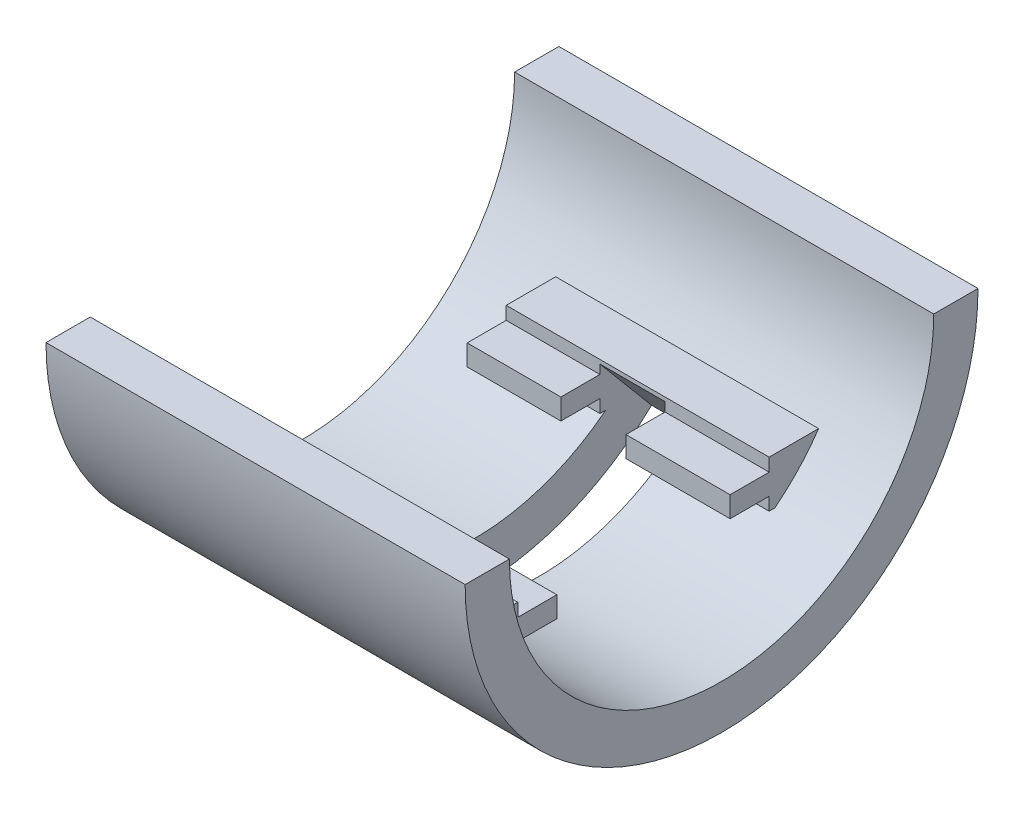
ISO-10303-21;
HEADER;
FILE_DESCRIPTION(('STEP AP214'),'2;1');
FILE_NAME('part.step','',(''),(''),'','','');
FILE_SCHEMA(('AUTOMOTIVE_DESIGN { 1 0 10303 214 1 1 1 1 }'));
ENDSEC;
DATA;
#1=APPLICATION_CONTEXT('core data for automotive mechanical design processes');
#2=APPLICATION_PROTOCOL_DEFINITION('international standard','automotive_design',2000,#1);
#3=PRODUCT_CONTEXT('',#1,'mechanical');
#4=PRODUCT('Part','Part','',(#3));
#5=PRODUCT_RELATED_PRODUCT_CATEGORY('part','',(#4));
#6=PRODUCT_DEFINITION_FORMATION('','',#4);
#7=PRODUCT_DEFINITION_CONTEXT('part definition',#1,'design');
#8=PRODUCT_DEFINITION('design','',#6,#7);
#9=PRODUCT_DEFINITION_SHAPE('','',#8);
#10=(LENGTH_UNIT() NAMED_UNIT(*) SI_UNIT(.MILLI.,.METRE.));
#11=(NAMED_UNIT(*) PLANE_ANGLE_UNIT() SI_UNIT($,.RADIAN.));
#12=(NAMED_UNIT(*) SI_UNIT($,.STERADIAN.) SOLID_ANGLE_UNIT());
#13=UNCERTAINTY_MEASURE_WITH_UNIT(LENGTH_MEASURE(1.E-05),#10,'distance_accuracy_value','');
#14=(GEOMETRIC_REPRESENTATION_CONTEXT(3) GLOBAL_UNCERTAINTY_ASSIGNED_CONTEXT((#13)) GLOBAL_UNIT_ASSIGNED_CONTEXT((#10,
#11,#12)) REPRESENTATION_CONTEXT('',''));
#15=CARTESIAN_POINT('',(0.,0.,0.));
#16=DIRECTION('',(0.,0.,1.));
#17=DIRECTION('',(1.,0.,0.));
#18=AXIS2_PLACEMENT_3D('',#15,#16,#17);
#19=CARTESIAN_POINT('',(0.,0.,0.));
#20=DIRECTION('',(0.,-1.,0.));
#21=DIRECTION('',(0.,0.,-1.));
#22=AXIS2_PLACEMENT_3D('',#19,#20,#21);
#23=PLANE('',#22);
#24=DIRECTION('',(1.,0.,0.));
#25=VECTOR('',#24,1.);
#26=CARTESIAN_POINT('',(-4.826,-1.74706743233033E-13,25.019));
#27=LINE('',#26,#25);
#28=CARTESIAN_POINT('',(0.,-1.74706743233033E-13,25.019));
#29=VERTEX_POINT('',#28);
#30=CARTESIAN_POINT('',(40.894,-1.74706743233033E-13,25.019));
#31=VERTEX_POINT('',#30);
#32=EDGE_CURVE('E267',#29,#31,#27,.T.);
#33=ORIENTED_EDGE('',*,*,#32,.T.);
#34=DIRECTION('',(0.,0.,1.));
#35=VECTOR('',#34,1.);
#36=CARTESIAN_POINT('',(40.894,0.,0.));
#37=LINE('',#36,#35);
#38=CARTESIAN_POINT('',(40.894,-1.44554310390783E-13,20.701));
#39=VERTEX_POINT('',#38);
#40=EDGE_CURVE('E277',#39,#31,#37,.T.);
#41=ORIENTED_EDGE('',*,*,#40,.F.);
#42=DIRECTION('',(-1.,0.,0.));
#43=VECTOR('',#42,1.);
#44=CARTESIAN_POINT('',(0.,-1.44554310390783E-13,20.701));
#45=LINE('',#44,#43);
#46=CARTESIAN_POINT('',(0.,0.,20.701));
#47=VERTEX_POINT('',#46);
#48=EDGE_CURVE('E292',#39,#47,#45,.T.);
#49=ORIENTED_EDGE('',*,*,#48,.T.);
#50=DIRECTION('',(0.,0.,-1.));
#51=VECTOR('',#50,1.);
#52=CARTESIAN_POINT('',(0.,0.,0.));
#53=LINE('',#52,#51);
#54=EDGE_CURVE('E278',#29,#47,#53,.T.);
#55=ORIENTED_EDGE('',*,*,#54,.F.);
#56=EDGE_LOOP('',(#33,#41,#49,#55));
#57=FACE_BOUND('',#56,.T.);
#58=ADVANCED_FACE('F34',(#57),#23,.F.);
#59=CARTESIAN_POINT('',(0.,0.,0.));
#60=DIRECTION('',(-1.,0.,0.));
#61=DIRECTION('',(0.,0.,1.));
#62=AXIS2_PLACEMENT_3D('',#59,#60,#61);
#63=PLANE('',#62);
#64=CARTESIAN_POINT('',(0.,1.44554310390783E-13,-20.701));
#65=VERTEX_POINT('',#64);
#66=CARTESIAN_POINT('',(0.,1.74706743233033E-13,-25.019));
#67=VERTEX_POINT('',#66);
#68=EDGE_CURVE('E286',#65,#67,#53,.T.);
#69=ORIENTED_EDGE('',*,*,#68,.T.);
#70=CARTESIAN_POINT('',(0.,0.,0.));
#71=DIRECTION('',(-1.,0.,0.));
#72=DIRECTION('',(0.,0.,1.));
#73=AXIS2_PLACEMENT_3D('',#70,#71,#72);
#74=CIRCLE('',#73,25.019);
#75=EDGE_CURVE('E49',#67,#29,#74,.T.);
#76=ORIENTED_EDGE('',*,*,#75,.T.);
#77=ORIENTED_EDGE('',*,*,#54,.T.);
#78=CARTESIAN_POINT('',(0.,0.,0.));
#79=DIRECTION('',(-1.,0.,0.));
#80=DIRECTION('',(0.,0.,1.));
#81=AXIS2_PLACEMENT_3D('',#78,#79,#80);
#82=CIRCLE('',#81,20.701);
#83=EDGE_CURVE('E514',#65,#47,#82,.T.);
#84=ORIENTED_EDGE('',*,*,#83,.F.);
#85=EDGE_LOOP('',(#69,#76,#77,#84));
#86=FACE_BOUND('',#85,.T.);
#87=ADVANCED_FACE('F521',(#86),#63,.T.);
#88=CARTESIAN_POINT('',(40.894,0.,0.));
#89=DIRECTION('',(1.,0.,0.));
#90=DIRECTION('',(0.,0.,-1.));
#91=AXIS2_PLACEMENT_3D('',#88,#89,#90);
#92=PLANE('',#91);
#93=ORIENTED_EDGE('',*,*,#40,.T.);
#94=CARTESIAN_POINT('',(40.894,0.,0.));
#95=DIRECTION('',(1.,0.,0.));
#96=DIRECTION('',(0.,0.,-1.));
#97=AXIS2_PLACEMENT_3D('',#94,#95,#96);
#98=CIRCLE('',#97,25.019);
#99=CARTESIAN_POINT('',(40.894,1.74706743233033E-13,-25.019));
#100=VERTEX_POINT('',#99);
#101=EDGE_CURVE('E264',#31,#100,#98,.T.);
#102=ORIENTED_EDGE('',*,*,#101,.T.);
#103=CARTESIAN_POINT('',(40.894,1.44554310390783E-13,-20.701));
#104=VERTEX_POINT('',#103);
#105=EDGE_CURVE('E283',#100,#104,#37,.T.);
#106=ORIENTED_EDGE('',*,*,#105,.T.);
#107=CARTESIAN_POINT('',(40.894,0.,0.));
#108=DIRECTION('',(1.,0.,0.));
#109=DIRECTION('',(0.,0.,-1.));
#110=AXIS2_PLACEMENT_3D('',#107,#108,#109);
#111=CIRCLE('',#110,20.701);
#112=EDGE_CURVE('E282',#39,#104,#111,.T.);
#113=ORIENTED_EDGE('',*,*,#112,.F.);
#114=EDGE_LOOP('',(#93,#102,#106,#113));
#115=FACE_BOUND('',#114,.T.);
#116=ADVANCED_FACE('F36',(#115),#92,.T.);
#117=DIRECTION('',(1.,0.,0.));
#118=VECTOR('',#117,1.);
#119=CARTESIAN_POINT('',(-4.826,1.74706743233033E-13,-25.019));
#120=LINE('',#119,#118);
#121=EDGE_CURVE('E268',#67,#100,#120,.T.);
#122=ORIENTED_EDGE('',*,*,#121,.F.);
#123=ORIENTED_EDGE('',*,*,#68,.F.);
#124=DIRECTION('',(-1.,0.,0.));
#125=VECTOR('',#124,1.);
#126=CARTESIAN_POINT('',(0.,1.44554310390783E-13,-20.701));
#127=LINE('',#126,#125);
#128=EDGE_CURVE('E285',#65,#104,#127,.F.);
#129=ORIENTED_EDGE('',*,*,#128,.T.);
#130=ORIENTED_EDGE('',*,*,#105,.F.);
#131=EDGE_LOOP('',(#122,#123,#129,#130));
#132=FACE_BOUND('',#131,.T.);
#133=ADVANCED_FACE('F523',(#132),#23,.F.);
#134=CARTESIAN_POINT('',(0.,0.594247114477798,-1.63268052860381));
#135=DIRECTION('',(0.,-0.642787609686541,0.766044443118977));
#136=DIRECTION('',(1.,0.,0.));
#137=AXIS2_PLACEMENT_3D('',#134,#135,#136);
#138=PLANE('',#137);
#139=DIRECTION('',(0.,-0.766044443118977,-0.642787609686541));
#140=VECTOR('',#139,1.);
#141=CARTESIAN_POINT('',(16.764,-21.1045473889342,-19.8401309934085));
#142=LINE('',#141,#140);
#143=CARTESIAN_POINT('',(16.764,-12.073833542669,-12.2624623357398));
#144=VERTEX_POINT('',#143);
#145=CARTESIAN_POINT('',(16.764,-18.0753465215828,-17.298329662852));
#146=VERTEX_POINT('',#145);
#147=EDGE_CURVE('E324',#144,#146,#142,.T.);
#148=ORIENTED_EDGE('',*,*,#147,.T.);
#149=DIRECTION('',(1.,0.,0.));
#150=VECTOR('',#149,1.);
#151=CARTESIAN_POINT('',(-4.826,-18.0753465215828,-17.298329662852));
#152=LINE('',#151,#150);
#153=CARTESIAN_POINT('',(23.114,-18.0753465215828,-17.298329662852));
#154=VERTEX_POINT('',#153);
#155=EDGE_CURVE('E57',#146,#154,#152,.T.);
#156=ORIENTED_EDGE('',*,*,#155,.T.);
#157=DIRECTION('',(0.,0.766044443118977,0.642787609686541));
#158=VECTOR('',#157,1.);
#159=CARTESIAN_POINT('',(23.114,-21.1045473889342,-19.8401309934085));
#160=LINE('',#159,#158);
#161=CARTESIAN_POINT('',(23.114,-12.073833542669,-12.2624623357398));
#162=VERTEX_POINT('',#161);
#163=EDGE_CURVE('E532',#154,#162,#160,.T.);
#164=ORIENTED_EDGE('',*,*,#163,.T.);
#165=DIRECTION('',(-1.,0.,0.));
#166=VECTOR('',#165,1.);
#167=CARTESIAN_POINT('',(33.274,-12.073833542669,-12.2624623357398));
#168=LINE('',#167,#166);
#169=EDGE_CURVE('E381',#162,#144,#168,.T.);
#170=ORIENTED_EDGE('',*,*,#169,.T.);
#171=EDGE_LOOP('',(#148,#156,#164,#170));
#172=FACE_BOUND('',#171,.T.);
#173=ADVANCED_FACE('F536',(#172),#138,.T.);
#174=CARTESIAN_POINT('',(0.,0.594247114477798,1.63268052860381));
#175=DIRECTION('',(0.,0.642787609686541,0.766044443118977));
#176=DIRECTION('',(1.,0.,0.));
#177=AXIS2_PLACEMENT_3D('',#174,#175,#176);
#178=PLANE('',#177);
#179=DIRECTION('',(1.,0.,0.));
#180=VECTOR('',#179,1.);
#181=CARTESIAN_POINT('',(-4.826,-18.0753465215828,17.298329662852));
#182=LINE('',#181,#180);
#183=CARTESIAN_POINT('',(16.764,-18.0753465215828,17.298329662852));
#184=VERTEX_POINT('',#183);
#185=CARTESIAN_POINT('',(23.114,-18.0753465215828,17.298329662852));
#186=VERTEX_POINT('',#185);
#187=EDGE_CURVE('E317',#184,#186,#182,.T.);
#188=ORIENTED_EDGE('',*,*,#187,.F.);
#189=DIRECTION('',(0.,-0.766044443118977,0.642787609686541));
#190=VECTOR('',#189,1.);
#191=CARTESIAN_POINT('',(16.764,-21.1045473889342,19.8401309934085));
#192=LINE('',#191,#190);
#193=CARTESIAN_POINT('',(16.764,-12.073833542669,12.2624623357398));
#194=VERTEX_POINT('',#193);
#195=EDGE_CURVE('E316',#194,#184,#192,.T.);
#196=ORIENTED_EDGE('',*,*,#195,.F.);
#197=DIRECTION('',(-1.,0.,0.));
#198=VECTOR('',#197,1.);
#199=CARTESIAN_POINT('',(33.274,-12.073833542669,12.2624623357398));
#200=LINE('',#199,#198);
#201=CARTESIAN_POINT('',(23.114,-12.073833542669,12.2624623357398));
#202=VERTEX_POINT('',#201);
#203=EDGE_CURVE('E42',#202,#194,#200,.T.);
#204=ORIENTED_EDGE('',*,*,#203,.F.);
#205=DIRECTION('',(0.,0.766044443118977,-0.642787609686541));
#206=VECTOR('',#205,1.);
#207=CARTESIAN_POINT('',(23.114,-21.1045473889342,19.8401309934085));
#208=LINE('',#207,#206);
#209=EDGE_CURVE('E314',#186,#202,#208,.T.);
#210=ORIENTED_EDGE('',*,*,#209,.F.);
#211=EDGE_LOOP('',(#188,#196,#204,#210));
#212=FACE_BOUND('',#211,.T.);
#213=ADVANCED_FACE('F313',(#212),#178,.F.);
#214=CARTESIAN_POINT('',(23.114,-21.1045473889342,19.8401309934085));
#215=DIRECTION('',(-1.,0.,0.));
#216=DIRECTION('',(0.,0.,1.));
#217=AXIS2_PLACEMENT_3D('',#214,#215,#216);
#218=PLANE('',#217);
#219=ORIENTED_EDGE('',*,*,#163,.F.);
#220=CARTESIAN_POINT('',(23.114,0.,0.));
#221=DIRECTION('',(-1.,0.,0.));
#222=DIRECTION('',(0.,0.,1.));
#223=AXIS2_PLACEMENT_3D('',#220,#221,#222);
#224=CIRCLE('',#223,25.019);
#225=EDGE_CURVE('E528',#154,#186,#224,.T.);
#226=ORIENTED_EDGE('',*,*,#225,.T.);
#227=ORIENTED_EDGE('',*,*,#209,.T.);
#228=DIRECTION('',(0.,-1.,0.));
#229=VECTOR('',#228,1.);
#230=CARTESIAN_POINT('',(23.114,-16.2560000000001,12.2624623357398));
#231=LINE('',#230,#229);
#232=CARTESIAN_POINT('',(23.114,-12.9540000000001,12.2624623357398));
#233=VERTEX_POINT('',#232);
#234=EDGE_CURVE('E308',#202,#233,#231,.T.);
#235=ORIENTED_EDGE('',*,*,#234,.T.);
#236=DIRECTION('',(0.,0.,1.));
#237=VECTOR('',#236,1.);
#238=CARTESIAN_POINT('',(23.114,-12.9540000000001,12.2624623357398));
#239=LINE('',#238,#237);
#240=CARTESIAN_POINT('',(23.114,-12.9540000000001,8.45246233573977));
#241=VERTEX_POINT('',#240);
#242=EDGE_CURVE('E297',#241,#233,#239,.T.);
#243=ORIENTED_EDGE('',*,*,#242,.F.);
#244=DIRECTION('',(0.,1.,0.));
#245=VECTOR('',#244,1.);
#246=CARTESIAN_POINT('',(23.114,-12.9540000000001,8.45246233573977));
#247=LINE('',#246,#245);
#248=CARTESIAN_POINT('',(23.114,-14.9860000000001,8.45246233573977));
#249=VERTEX_POINT('',#248);
#250=EDGE_CURVE('E352',#249,#241,#247,.T.);
#251=ORIENTED_EDGE('',*,*,#250,.F.);
#252=DIRECTION('',(0.,0.,-1.));
#253=VECTOR('',#252,1.);
#254=CARTESIAN_POINT('',(23.114,-14.9860000000001,12.2624623357398));
#255=LINE('',#254,#253);
#256=CARTESIAN_POINT('',(23.114,-14.9860000000001,12.2624623357398));
#257=VERTEX_POINT('',#256);
#258=EDGE_CURVE('E355',#257,#249,#255,.T.);
#259=ORIENTED_EDGE('',*,*,#258,.F.);
#260=DIRECTION('',(0.,-1.,0.));
#261=VECTOR('',#260,1.);
#262=CARTESIAN_POINT('',(23.114,-16.2560000000001,12.2624623357398));
#263=LINE('',#262,#261);
#264=CARTESIAN_POINT('',(23.114,-16.2560000000001,12.2624623357398));
#265=VERTEX_POINT('',#264);
#266=EDGE_CURVE('E359',#257,#265,#263,.T.);
#267=ORIENTED_EDGE('',*,*,#266,.T.);
#268=DIRECTION('',(0.,0.,1.));
#269=VECTOR('',#268,1.);
#270=CARTESIAN_POINT('',(23.114,-16.2560000000001,25.401));
#271=LINE('',#270,#269);
#272=CARTESIAN_POINT('',(23.114,-16.2560000000001,12.8169366464844));
#273=VERTEX_POINT('',#272);
#274=EDGE_CURVE('E361',#265,#273,#271,.T.);
#275=ORIENTED_EDGE('',*,*,#274,.T.);
#276=CARTESIAN_POINT('',(23.114,0.,0.));
#277=DIRECTION('',(-1.,0.,0.));
#278=DIRECTION('',(0.,0.,1.));
#279=AXIS2_PLACEMENT_3D('',#276,#277,#278);
#280=CIRCLE('',#279,20.701);
#281=CARTESIAN_POINT('',(23.114,-16.2560000000001,-12.8169366464844));
#282=VERTEX_POINT('',#281);
#283=EDGE_CURVE('E363',#273,#282,#280,.F.);
#284=ORIENTED_EDGE('',*,*,#283,.T.);
#285=DIRECTION('',(0.,0.,1.));
#286=VECTOR('',#285,1.);
#287=CARTESIAN_POINT('',(23.114,-16.2560000000001,25.401));
#288=LINE('',#287,#286);
#289=CARTESIAN_POINT('',(23.114,-16.2560000000001,-12.2624623357397));
#290=VERTEX_POINT('',#289);
#291=EDGE_CURVE('E365',#282,#290,#288,.T.);
#292=ORIENTED_EDGE('',*,*,#291,.T.);
#293=DIRECTION('',(0.,1.,0.));
#294=VECTOR('',#293,1.);
#295=CARTESIAN_POINT('',(23.114,-16.2560000000001,-12.2624623357398));
#296=LINE('',#295,#294);
#297=CARTESIAN_POINT('',(23.114,-14.9860000000001,-12.2624623357398));
#298=VERTEX_POINT('',#297);
#299=EDGE_CURVE('E367',#290,#298,#296,.T.);
#300=ORIENTED_EDGE('',*,*,#299,.T.);
#301=DIRECTION('',(0.,0.,-1.));
#302=VECTOR('',#301,1.);
#303=CARTESIAN_POINT('',(23.114,-14.9860000000001,-12.2624623357398));
#304=LINE('',#303,#302);
#305=CARTESIAN_POINT('',(23.114,-14.9860000000001,-8.45246233573976));
#306=VERTEX_POINT('',#305);
#307=EDGE_CURVE('E369',#306,#298,#304,.T.);
#308=ORIENTED_EDGE('',*,*,#307,.F.);
#309=DIRECTION('',(0.,-1.,0.));
#310=VECTOR('',#309,1.);
#311=CARTESIAN_POINT('',(23.114,-12.9540000000001,-8.45246233573977));
#312=LINE('',#311,#310);
#313=CARTESIAN_POINT('',(23.114,-12.9540000000001,-8.45246233573977));
#314=VERTEX_POINT('',#313);
#315=EDGE_CURVE('E372',#314,#306,#312,.T.);
#316=ORIENTED_EDGE('',*,*,#315,.F.);
#317=DIRECTION('',(0.,0.,1.));
#318=VECTOR('',#317,1.);
#319=CARTESIAN_POINT('',(23.114,-12.9540000000001,-12.2624623357398));
#320=LINE('',#319,#318);
#321=CARTESIAN_POINT('',(23.114,-12.9540000000001,-12.2624623357398));
#322=VERTEX_POINT('',#321);
#323=EDGE_CURVE('E375',#322,#314,#320,.T.);
#324=ORIENTED_EDGE('',*,*,#323,.F.);
#325=DIRECTION('',(0.,1.,0.));
#326=VECTOR('',#325,1.);
#327=CARTESIAN_POINT('',(23.114,-16.2560000000001,-12.2624623357398));
#328=LINE('',#327,#326);
#329=EDGE_CURVE('E378',#322,#162,#328,.T.);
#330=ORIENTED_EDGE('',*,*,#329,.T.);
#331=EDGE_LOOP('',(#219,#226,#227,#235,#243,#251,#259,#267,#275,#284,#292,#300,#308,#316,#324,#330));
#332=FACE_BOUND('',#331,.T.);
#333=ADVANCED_FACE('F613',(#332),#218,.T.);
#334=CARTESIAN_POINT('',(16.764,-21.1045473889342,19.8401309934085));
#335=DIRECTION('',(1.,0.,0.));
#336=DIRECTION('',(0.,0.,-1.));
#337=AXIS2_PLACEMENT_3D('',#334,#335,#336);
#338=PLANE('',#337);
#339=ORIENTED_EDGE('',*,*,#195,.T.);
#340=CARTESIAN_POINT('',(16.764,0.,0.));
#341=DIRECTION('',(1.,0.,0.));
#342=DIRECTION('',(0.,0.,-1.));
#343=AXIS2_PLACEMENT_3D('',#340,#341,#342);
#344=CIRCLE('',#343,25.019);
#345=EDGE_CURVE('E11',#184,#146,#344,.T.);
#346=ORIENTED_EDGE('',*,*,#345,.T.);
#347=ORIENTED_EDGE('',*,*,#147,.F.);
#348=DIRECTION('',(0.,-1.,0.));
#349=VECTOR('',#348,1.);
#350=CARTESIAN_POINT('',(16.764,-16.2560000000001,-12.2624623357398));
#351=LINE('',#350,#349);
#352=CARTESIAN_POINT('',(16.764,-12.9540000000001,-12.2624623357398));
#353=VERTEX_POINT('',#352);
#354=EDGE_CURVE('E350',#144,#353,#351,.T.);
#355=ORIENTED_EDGE('',*,*,#354,.T.);
#356=DIRECTION('',(0.,0.,-1.));
#357=VECTOR('',#356,1.);
#358=CARTESIAN_POINT('',(16.764,-12.9540000000001,-12.2624623357398));
#359=LINE('',#358,#357);
#360=CARTESIAN_POINT('',(16.764,-12.9540000000001,-8.45246233573977));
#361=VERTEX_POINT('',#360);
#362=EDGE_CURVE('E347',#361,#353,#359,.T.);
#363=ORIENTED_EDGE('',*,*,#362,.F.);
#364=DIRECTION('',(0.,1.,0.));
#365=VECTOR('',#364,1.);
#366=CARTESIAN_POINT('',(16.764,-12.9540000000001,-8.45246233573977));
#367=LINE('',#366,#365);
#368=CARTESIAN_POINT('',(16.764,-14.9860000000001,-8.45246233573976));
#369=VERTEX_POINT('',#368);
#370=EDGE_CURVE('E344',#369,#361,#367,.T.);
#371=ORIENTED_EDGE('',*,*,#370,.F.);
#372=DIRECTION('',(0.,0.,1.));
#373=VECTOR('',#372,1.);
#374=CARTESIAN_POINT('',(16.764,-14.9860000000001,-12.2624623357398));
#375=LINE('',#374,#373);
#376=CARTESIAN_POINT('',(16.764,-14.9860000000001,-12.2624623357398));
#377=VERTEX_POINT('',#376);
#378=EDGE_CURVE('E341',#377,#369,#375,.T.);
#379=ORIENTED_EDGE('',*,*,#378,.F.);
#380=DIRECTION('',(0.,-1.,0.));
#381=VECTOR('',#380,1.);
#382=CARTESIAN_POINT('',(16.764,-16.2560000000001,-12.2624623357398));
#383=LINE('',#382,#381);
#384=CARTESIAN_POINT('',(16.764,-16.2560000000001,-12.2624623357397));
#385=VERTEX_POINT('',#384);
#386=EDGE_CURVE('E339',#377,#385,#383,.T.);
#387=ORIENTED_EDGE('',*,*,#386,.T.);
#388=DIRECTION('',(0.,0.,-1.));
#389=VECTOR('',#388,1.);
#390=CARTESIAN_POINT('',(16.764,-16.2560000000001,25.401));
#391=LINE('',#390,#389);
#392=CARTESIAN_POINT('',(16.764,-16.2560000000001,-12.8169366464844));
#393=VERTEX_POINT('',#392);
#394=EDGE_CURVE('E337',#385,#393,#391,.T.);
#395=ORIENTED_EDGE('',*,*,#394,.T.);
#396=CARTESIAN_POINT('',(16.764,0.,0.));
#397=DIRECTION('',(1.,0.,0.));
#398=DIRECTION('',(0.,0.,-1.));
#399=AXIS2_PLACEMENT_3D('',#396,#397,#398);
#400=CIRCLE('',#399,20.701);
#401=CARTESIAN_POINT('',(16.764,-16.2560000000001,12.8169366464844));
#402=VERTEX_POINT('',#401);
#403=EDGE_CURVE('E335',#393,#402,#400,.F.);
#404=ORIENTED_EDGE('',*,*,#403,.T.);
#405=DIRECTION('',(0.,0.,-1.));
#406=VECTOR('',#405,1.);
#407=CARTESIAN_POINT('',(16.764,-16.2560000000001,25.401));
#408=LINE('',#407,#406);
#409=CARTESIAN_POINT('',(16.764,-16.2560000000001,12.2624623357398));
#410=VERTEX_POINT('',#409);
#411=EDGE_CURVE('E333',#402,#410,#408,.T.);
#412=ORIENTED_EDGE('',*,*,#411,.T.);
#413=DIRECTION('',(0.,1.,0.));
#414=VECTOR('',#413,1.);
#415=CARTESIAN_POINT('',(16.764,-16.2560000000001,12.2624623357398));
#416=LINE('',#415,#414);
#417=CARTESIAN_POINT('',(16.764,-14.9860000000001,12.2624623357398));
#418=VERTEX_POINT('',#417);
#419=EDGE_CURVE('E331',#410,#418,#416,.T.);
#420=ORIENTED_EDGE('',*,*,#419,.T.);
#421=DIRECTION('',(0.,0.,1.));
#422=VECTOR('',#421,1.);
#423=CARTESIAN_POINT('',(16.764,-14.9860000000001,12.2624623357398));
#424=LINE('',#423,#422);
#425=CARTESIAN_POINT('',(16.764,-14.9860000000001,8.45246233573977));
#426=VERTEX_POINT('',#425);
#427=EDGE_CURVE('E322',#426,#418,#424,.T.);
#428=ORIENTED_EDGE('',*,*,#427,.F.);
#429=DIRECTION('',(0.,-1.,0.));
#430=VECTOR('',#429,1.);
#431=CARTESIAN_POINT('',(16.764,-12.9540000000001,8.45246233573977));
#432=LINE('',#431,#430);
#433=CARTESIAN_POINT('',(16.764,-12.9540000000001,8.45246233573977));
#434=VERTEX_POINT('',#433);
#435=EDGE_CURVE('E319',#434,#426,#432,.T.);
#436=ORIENTED_EDGE('',*,*,#435,.F.);
#437=DIRECTION('',(0.,0.,-1.));
#438=VECTOR('',#437,1.);
#439=CARTESIAN_POINT('',(16.764,-12.9540000000001,12.2624623357398));
#440=LINE('',#439,#438);
#441=CARTESIAN_POINT('',(16.764,-12.9540000000001,12.2624623357398));
#442=VERTEX_POINT('',#441);
#443=EDGE_CURVE('E294',#442,#434,#440,.T.);
#444=ORIENTED_EDGE('',*,*,#443,.F.);
#445=DIRECTION('',(0.,1.,0.));
#446=VECTOR('',#445,1.);
#447=CARTESIAN_POINT('',(16.764,-16.2560000000001,12.2624623357398));
#448=LINE('',#447,#446);
#449=EDGE_CURVE('E305',#442,#194,#448,.T.);
#450=ORIENTED_EDGE('',*,*,#449,.T.);
#451=EDGE_LOOP('',(#339,#346,#347,#355,#363,#371,#379,#387,#395,#404,#412,#420,#428,#436,#444,#450));
#452=FACE_BOUND('',#451,.T.);
#453=ADVANCED_FACE('F540',(#452),#338,.T.);
#454=CARTESIAN_POINT('',(33.274,-16.2560000000001,12.2624623357398));
#455=DIRECTION('',(0.,0.,1.));
#456=DIRECTION('',(1.,0.,0.));
#457=AXIS2_PLACEMENT_3D('',#454,#455,#456);
#458=PLANE('',#457);
#459=ORIENTED_EDGE('',*,*,#266,.F.);
#460=DIRECTION('',(-1.,0.,0.));
#461=VECTOR('',#460,1.);
#462=CARTESIAN_POINT('',(37.592,-14.9860000000001,12.2624623357398));
#463=LINE('',#462,#461);
#464=CARTESIAN_POINT('',(33.274,-14.9860000000001,12.2624623357398));
#465=VERTEX_POINT('',#464);
#466=EDGE_CURVE('E387',#465,#257,#463,.T.);
#467=ORIENTED_EDGE('',*,*,#466,.F.);
#468=DIRECTION('',(0.,1.,0.));
#469=VECTOR('',#468,1.);
#470=CARTESIAN_POINT('',(33.274,-16.2560000000001,12.2624623357398));
#471=LINE('',#470,#469);
#472=CARTESIAN_POINT('',(33.274,-16.2560000000001,12.2624623357398));
#473=VERTEX_POINT('',#472);
#474=EDGE_CURVE('E461',#473,#465,#471,.T.);
#475=ORIENTED_EDGE('',*,*,#474,.F.);
#476=DIRECTION('',(1.,0.,0.));
#477=VECTOR('',#476,1.);
#478=CARTESIAN_POINT('',(33.274,-16.2560000000001,12.2624623357398));
#479=LINE('',#478,#477);
#480=EDGE_CURVE('E450',#265,#473,#479,.T.);
#481=ORIENTED_EDGE('',*,*,#480,.F.);
#482=EDGE_LOOP('',(#459,#467,#475,#481));
#483=FACE_BOUND('',#482,.T.);
#484=ADVANCED_FACE('F624',(#483),#458,.F.);
#485=ORIENTED_EDGE('',*,*,#419,.F.);
#486=CARTESIAN_POINT('',(7.62,-16.2560000000001,12.2624623357398));
#487=VERTEX_POINT('',#486);
#488=EDGE_CURVE('E452',#487,#410,#479,.T.);
#489=ORIENTED_EDGE('',*,*,#488,.F.);
#490=DIRECTION('',(0.,1.,0.));
#491=VECTOR('',#490,1.);
#492=CARTESIAN_POINT('',(7.62,-16.2560000000001,12.2624623357398));
#493=LINE('',#492,#491);
#494=CARTESIAN_POINT('',(7.62,-14.9860000000001,12.2624623357398));
#495=VERTEX_POINT('',#494);
#496=EDGE_CURVE('E466',#487,#495,#493,.T.);
#497=ORIENTED_EDGE('',*,*,#496,.T.);
#498=EDGE_CURVE('E401',#418,#495,#463,.T.);
#499=ORIENTED_EDGE('',*,*,#498,.F.);
#500=EDGE_LOOP('',(#485,#489,#497,#499));
#501=FACE_BOUND('',#500,.T.);
#502=ADVANCED_FACE('F582',(#501),#458,.F.);
#503=CARTESIAN_POINT('',(33.274,-16.2560000000001,-12.2624623357398));
#504=DIRECTION('',(0.,0.,-1.));
#505=DIRECTION('',(-1.,0.,0.));
#506=AXIS2_PLACEMENT_3D('',#503,#504,#505);
#507=PLANE('',#506);
#508=ORIENTED_EDGE('',*,*,#329,.F.);
#509=DIRECTION('',(-1.,0.,0.));
#510=VECTOR('',#509,1.);
#511=CARTESIAN_POINT('',(37.592,-12.9540000000001,-12.2624623357398));
#512=LINE('',#511,#510);
#513=CARTESIAN_POINT('',(33.274,-12.9540000000001,-12.2624623357398));
#514=VERTEX_POINT('',#513);
#515=EDGE_CURVE('E418',#514,#322,#512,.T.);
#516=ORIENTED_EDGE('',*,*,#515,.F.);
#517=DIRECTION('',(0.,1.,0.));
#518=VECTOR('',#517,1.);
#519=CARTESIAN_POINT('',(33.274,-16.2560000000001,-12.2624623357398));
#520=LINE('',#519,#518);
#521=CARTESIAN_POINT('',(33.274,-11.6840000000001,-12.2624623357398));
#522=VERTEX_POINT('',#521);
#523=EDGE_CURVE('E455',#514,#522,#520,.T.);
#524=ORIENTED_EDGE('',*,*,#523,.T.);
#525=DIRECTION('',(-1.,0.,0.));
#526=VECTOR('',#525,1.);
#527=CARTESIAN_POINT('',(33.274,-11.6840000000001,-12.2624623357398));
#528=LINE('',#527,#526);
#529=CARTESIAN_POINT('',(7.62,-11.6840000000001,-12.2624623357398));
#530=VERTEX_POINT('',#529);
#531=EDGE_CURVE('E446',#522,#530,#528,.T.);
#532=ORIENTED_EDGE('',*,*,#531,.T.);
#533=DIRECTION('',(0.,1.,0.));
#534=VECTOR('',#533,1.);
#535=CARTESIAN_POINT('',(7.62,-16.2560000000001,-12.2624623357398));
#536=LINE('',#535,#534);
#537=CARTESIAN_POINT('',(7.62,-12.9540000000001,-12.2624623357398));
#538=VERTEX_POINT('',#537);
#539=EDGE_CURVE('E473',#538,#530,#536,.T.);
#540=ORIENTED_EDGE('',*,*,#539,.F.);
#541=EDGE_CURVE('E432',#353,#538,#512,.T.);
#542=ORIENTED_EDGE('',*,*,#541,.F.);
#543=ORIENTED_EDGE('',*,*,#354,.F.);
#544=ORIENTED_EDGE('',*,*,#169,.F.);
#545=EDGE_LOOP('',(#508,#516,#524,#532,#540,#542,#543,#544));
#546=FACE_BOUND('',#545,.T.);
#547=ADVANCED_FACE('F544',(#546),#507,.F.);
#548=CARTESIAN_POINT('',(33.274,-16.2560000000001,25.401));
#549=DIRECTION('',(0.,1.,0.));
#550=DIRECTION('',(-1.,0.,0.));
#551=AXIS2_PLACEMENT_3D('',#548,#549,#550);
#552=PLANE('',#551);
#553=ORIENTED_EDGE('',*,*,#274,.F.);
#554=ORIENTED_EDGE('',*,*,#480,.T.);
#555=DIRECTION('',(0.,0.,-1.));
#556=VECTOR('',#555,1.);
#557=CARTESIAN_POINT('',(33.274,-16.2560000000001,25.401));
#558=LINE('',#557,#556);
#559=CARTESIAN_POINT('',(33.274,-16.2560000000001,12.8169366464844));
#560=VERTEX_POINT('',#559);
#561=EDGE_CURVE('E497',#560,#473,#558,.T.);
#562=ORIENTED_EDGE('',*,*,#561,.F.);
#563=DIRECTION('',(-1.,0.,0.));
#564=VECTOR('',#563,1.);
#565=CARTESIAN_POINT('',(0.,-16.2560000000001,12.8169366464844));
#566=LINE('',#565,#564);
#567=EDGE_CURVE('E496',#273,#560,#566,.F.);
#568=ORIENTED_EDGE('',*,*,#567,.F.);
#569=EDGE_LOOP('',(#553,#554,#562,#568));
#570=FACE_BOUND('',#569,.T.);
#571=ADVANCED_FACE('F628',(#570),#552,.F.);
#572=ORIENTED_EDGE('',*,*,#411,.F.);
#573=CARTESIAN_POINT('',(7.62,-16.2560000000001,12.8169366464844));
#574=VERTEX_POINT('',#573);
#575=EDGE_CURVE('E511',#574,#402,#566,.F.);
#576=ORIENTED_EDGE('',*,*,#575,.F.);
#577=DIRECTION('',(0.,0.,-1.));
#578=VECTOR('',#577,1.);
#579=CARTESIAN_POINT('',(7.62,-16.2560000000001,25.401));
#580=LINE('',#579,#578);
#581=EDGE_CURVE('E501',#574,#487,#580,.T.);
#582=ORIENTED_EDGE('',*,*,#581,.T.);
#583=ORIENTED_EDGE('',*,*,#488,.T.);
#584=EDGE_LOOP('',(#572,#576,#582,#583));
#585=FACE_BOUND('',#584,.T.);
#586=ADVANCED_FACE('F578',(#585),#552,.F.);
#587=CARTESIAN_POINT('',(0.,0.,0.));
#588=DIRECTION('',(-1.,0.,0.));
#589=DIRECTION('',(0.,0.,1.));
#590=AXIS2_PLACEMENT_3D('',#587,#588,#589);
#591=CYLINDRICAL_SURFACE('',#590,20.701);
#592=ORIENTED_EDGE('',*,*,#112,.T.);
#593=ORIENTED_EDGE('',*,*,#128,.F.);
#594=ORIENTED_EDGE('',*,*,#83,.T.);
#595=ORIENTED_EDGE('',*,*,#48,.F.);
#596=EDGE_LOOP('',(#592,#593,#594,#595));
#597=FACE_BOUND('',#596,.T.);
#598=ORIENTED_EDGE('',*,*,#283,.F.);
#599=ORIENTED_EDGE('',*,*,#567,.T.);
#600=CARTESIAN_POINT('',(33.274,0.,0.));
#601=DIRECTION('',(-1.,0.,0.));
#602=DIRECTION('',(0.,0.,1.));
#603=AXIS2_PLACEMENT_3D('',#600,#601,#602);
#604=CIRCLE('',#603,20.701);
#605=CARTESIAN_POINT('',(33.274,-11.6840000000001,17.0884623357398));
#606=VERTEX_POINT('',#605);
#607=EDGE_CURVE('E494',#560,#606,#604,.T.);
#608=ORIENTED_EDGE('',*,*,#607,.T.);
#609=DIRECTION('',(-1.,0.,0.));
#610=VECTOR('',#609,1.);
#611=CARTESIAN_POINT('',(0.,-11.6840000000001,17.0884623357398));
#612=LINE('',#611,#610);
#613=CARTESIAN_POINT('',(7.62,-11.6840000000001,17.0884623357398));
#614=VERTEX_POINT('',#613);
#615=EDGE_CURVE('E491',#606,#614,#612,.T.);
#616=ORIENTED_EDGE('',*,*,#615,.T.);
#617=CARTESIAN_POINT('',(7.62,0.,0.));
#618=DIRECTION('',(1.,0.,0.));
#619=DIRECTION('',(0.,1.,0.));
#620=AXIS2_PLACEMENT_3D('',#617,#618,#619);
#621=CIRCLE('',#620,20.701);
#622=EDGE_CURVE('E489',#614,#574,#621,.T.);
#623=ORIENTED_EDGE('',*,*,#622,.T.);
#624=ORIENTED_EDGE('',*,*,#575,.T.);
#625=ORIENTED_EDGE('',*,*,#403,.F.);
#626=DIRECTION('',(-1.,0.,0.));
#627=VECTOR('',#626,1.);
#628=CARTESIAN_POINT('',(0.,-16.2560000000001,-12.8169366464844));
#629=LINE('',#628,#627);
#630=CARTESIAN_POINT('',(7.62,-16.2560000000001,-12.8169366464844));
#631=VERTEX_POINT('',#630);
#632=EDGE_CURVE('E480',#631,#393,#629,.F.);
#633=ORIENTED_EDGE('',*,*,#632,.F.);
#634=CARTESIAN_POINT('',(7.62,0.,0.));
#635=DIRECTION('',(-1.,0.,0.));
#636=DIRECTION('',(0.,-1.,0.));
#637=AXIS2_PLACEMENT_3D('',#634,#635,#636);
#638=CIRCLE('',#637,20.701);
#639=CARTESIAN_POINT('',(7.62,-11.6840000000001,-17.0884623357398));
#640=VERTEX_POINT('',#639);
#641=EDGE_CURVE('E476',#640,#631,#638,.T.);
#642=ORIENTED_EDGE('',*,*,#641,.F.);
#643=DIRECTION('',(-1.,0.,0.));
#644=VECTOR('',#643,1.);
#645=CARTESIAN_POINT('',(0.,-11.6840000000001,-17.0884623357398));
#646=LINE('',#645,#644);
#647=CARTESIAN_POINT('',(33.274,-11.6840000000001,-17.0884623357398));
#648=VERTEX_POINT('',#647);
#649=EDGE_CURVE('E464',#648,#640,#646,.T.);
#650=ORIENTED_EDGE('',*,*,#649,.F.);
#651=CARTESIAN_POINT('',(33.274,0.,0.));
#652=DIRECTION('',(1.,0.,0.));
#653=DIRECTION('',(0.,0.,-1.));
#654=AXIS2_PLACEMENT_3D('',#651,#652,#653);
#655=CIRCLE('',#654,20.701);
#656=CARTESIAN_POINT('',(33.274,-16.2560000000001,-12.8169366464844));
#657=VERTEX_POINT('',#656);
#658=EDGE_CURVE('E483',#657,#648,#655,.T.);
#659=ORIENTED_EDGE('',*,*,#658,.F.);
#660=EDGE_CURVE('E479',#282,#657,#629,.F.);
#661=ORIENTED_EDGE('',*,*,#660,.F.);
#662=EDGE_LOOP('',(#598,#599,#608,#616,#623,#624,#625,#633,#642,#650,#659,#661));
#663=FACE_BOUND('',#662,.T.);
#664=ADVANCED_FACE('F572',(#597,#663),#591,.F.);
#665=ORIENTED_EDGE('',*,*,#291,.F.);
#666=ORIENTED_EDGE('',*,*,#660,.T.);
#667=CARTESIAN_POINT('',(33.274,-16.2560000000001,-12.2624623357398));
#668=VERTEX_POINT('',#667);
#669=EDGE_CURVE('E486',#668,#657,#558,.T.);
#670=ORIENTED_EDGE('',*,*,#669,.F.);
#671=DIRECTION('',(-1.,0.,0.));
#672=VECTOR('',#671,1.);
#673=CARTESIAN_POINT('',(33.274,-16.2560000000001,-12.2624623357398));
#674=LINE('',#673,#672);
#675=EDGE_CURVE('E447',#668,#290,#674,.T.);
#676=ORIENTED_EDGE('',*,*,#675,.T.);
#677=EDGE_LOOP('',(#665,#666,#670,#676));
#678=FACE_BOUND('',#677,.T.);
#679=ADVANCED_FACE('F638',(#678),#552,.F.);
#680=ORIENTED_EDGE('',*,*,#394,.F.);
#681=CARTESIAN_POINT('',(7.62,-16.2560000000001,-12.2624623357397));
#682=VERTEX_POINT('',#681);
#683=EDGE_CURVE('E451',#385,#682,#674,.T.);
#684=ORIENTED_EDGE('',*,*,#683,.T.);
#685=EDGE_CURVE('E500',#682,#631,#580,.T.);
#686=ORIENTED_EDGE('',*,*,#685,.T.);
#687=ORIENTED_EDGE('',*,*,#632,.T.);
#688=EDGE_LOOP('',(#680,#684,#686,#687));
#689=FACE_BOUND('',#688,.T.);
#690=ADVANCED_FACE('F566',(#689),#552,.F.);
#691=ORIENTED_EDGE('',*,*,#299,.F.);
#692=ORIENTED_EDGE('',*,*,#675,.F.);
#693=CARTESIAN_POINT('',(33.274,-14.9860000000001,-12.2624623357398));
#694=VERTEX_POINT('',#693);
#695=EDGE_CURVE('E474',#668,#694,#520,.T.);
#696=ORIENTED_EDGE('',*,*,#695,.T.);
#697=DIRECTION('',(-1.,0.,0.));
#698=VECTOR('',#697,1.);
#699=CARTESIAN_POINT('',(37.592,-14.9860000000001,-12.2624623357398));
#700=LINE('',#699,#698);
#701=EDGE_CURVE('E441',#694,#298,#700,.T.);
#702=ORIENTED_EDGE('',*,*,#701,.T.);
#703=EDGE_LOOP('',(#691,#692,#696,#702));
#704=FACE_BOUND('',#703,.T.);
#705=ADVANCED_FACE('F647',(#704),#507,.F.);
#706=ORIENTED_EDGE('',*,*,#386,.F.);
#707=CARTESIAN_POINT('',(7.62,-14.9860000000001,-12.2624623357398));
#708=VERTEX_POINT('',#707);
#709=EDGE_CURVE('E429',#377,#708,#700,.T.);
#710=ORIENTED_EDGE('',*,*,#709,.T.);
#711=EDGE_CURVE('E470',#682,#708,#536,.T.);
#712=ORIENTED_EDGE('',*,*,#711,.F.);
#713=ORIENTED_EDGE('',*,*,#683,.F.);
#714=EDGE_LOOP('',(#706,#710,#712,#713));
#715=FACE_BOUND('',#714,.T.);
#716=ADVANCED_FACE('F562',(#715),#507,.F.);
#717=ORIENTED_EDGE('',*,*,#234,.F.);
#718=ORIENTED_EDGE('',*,*,#203,.T.);
#719=ORIENTED_EDGE('',*,*,#449,.F.);
#720=DIRECTION('',(-1.,0.,0.));
#721=VECTOR('',#720,1.);
#722=CARTESIAN_POINT('',(37.592,-12.9540000000001,12.2624623357398));
#723=LINE('',#722,#721);
#724=CARTESIAN_POINT('',(7.62,-12.9540000000001,12.2624623357398));
#725=VERTEX_POINT('',#724);
#726=EDGE_CURVE('E398',#442,#725,#723,.T.);
#727=ORIENTED_EDGE('',*,*,#726,.T.);
#728=CARTESIAN_POINT('',(7.62,-11.6840000000001,12.2624623357398));
#729=VERTEX_POINT('',#728);
#730=EDGE_CURVE('E469',#725,#729,#493,.T.);
#731=ORIENTED_EDGE('',*,*,#730,.T.);
#732=DIRECTION('',(1.,0.,0.));
#733=VECTOR('',#732,1.);
#734=CARTESIAN_POINT('',(33.274,-11.6840000000001,12.2624623357398));
#735=LINE('',#734,#733);
#736=CARTESIAN_POINT('',(33.274,-11.6840000000001,12.2624623357398));
#737=VERTEX_POINT('',#736);
#738=EDGE_CURVE('E458',#729,#737,#735,.T.);
#739=ORIENTED_EDGE('',*,*,#738,.T.);
#740=CARTESIAN_POINT('',(33.274,-12.9540000000001,12.2624623357398));
#741=VERTEX_POINT('',#740);
#742=EDGE_CURVE('E465',#741,#737,#471,.T.);
#743=ORIENTED_EDGE('',*,*,#742,.F.);
#744=EDGE_CURVE('E410',#741,#233,#723,.T.);
#745=ORIENTED_EDGE('',*,*,#744,.T.);
#746=EDGE_LOOP('',(#717,#718,#719,#727,#731,#739,#743,#745));
#747=FACE_BOUND('',#746,.T.);
#748=ADVANCED_FACE('F304',(#747),#458,.F.);
#749=CARTESIAN_POINT('',(37.592,-12.9540000000001,-12.2624623357398));
#750=DIRECTION('',(0.,1.,0.));
#751=DIRECTION('',(0.,0.,1.));
#752=AXIS2_PLACEMENT_3D('',#749,#750,#751);
#753=PLANE('',#752);
#754=ORIENTED_EDGE('',*,*,#515,.T.);
#755=ORIENTED_EDGE('',*,*,#323,.T.);
#756=DIRECTION('',(-1.,0.,0.));
#757=VECTOR('',#756,1.);
#758=CARTESIAN_POINT('',(37.592,-12.9540000000001,-8.45246233573977));
#759=LINE('',#758,#757);
#760=CARTESIAN_POINT('',(33.274,-12.9540000000001,-8.45246233573977));
#761=VERTEX_POINT('',#760);
#762=EDGE_CURVE('E433',#761,#314,#759,.T.);
#763=ORIENTED_EDGE('',*,*,#762,.F.);
#764=DIRECTION('',(0.,0.,1.));
#765=VECTOR('',#764,1.);
#766=CARTESIAN_POINT('',(33.274,-12.9540000000001,-12.2624623357398));
#767=LINE('',#766,#765);
#768=EDGE_CURVE('E417',#514,#761,#767,.T.);
#769=ORIENTED_EDGE('',*,*,#768,.F.);
#770=EDGE_LOOP('',(#754,#755,#763,#769));
#771=FACE_BOUND('',#770,.T.);
#772=ADVANCED_FACE('F656',(#771),#753,.T.);
#773=CARTESIAN_POINT('',(7.62,-12.9540000000001,-8.45246233573977));
#774=VERTEX_POINT('',#773);
#775=EDGE_CURVE('E436',#361,#774,#759,.T.);
#776=ORIENTED_EDGE('',*,*,#775,.F.);
#777=ORIENTED_EDGE('',*,*,#362,.T.);
#778=ORIENTED_EDGE('',*,*,#541,.T.);
#779=DIRECTION('',(0.,0.,-1.));
#780=VECTOR('',#779,1.);
#781=CARTESIAN_POINT('',(7.62,-12.9540000000001,-12.2624623357398));
#782=LINE('',#781,#780);
#783=EDGE_CURVE('E426',#774,#538,#782,.T.);
#784=ORIENTED_EDGE('',*,*,#783,.F.);
#785=EDGE_LOOP('',(#776,#777,#778,#784));
#786=FACE_BOUND('',#785,.T.);
#787=ADVANCED_FACE('F549',(#786),#753,.T.);
#788=CARTESIAN_POINT('',(37.592,-12.9540000000001,-8.45246233573977));
#789=DIRECTION('',(0.,0.,1.));
#790=DIRECTION('',(0.,-1.,0.));
#791=AXIS2_PLACEMENT_3D('',#788,#789,#790);
#792=PLANE('',#791);
#793=ORIENTED_EDGE('',*,*,#762,.T.);
#794=ORIENTED_EDGE('',*,*,#315,.T.);
#795=DIRECTION('',(-1.,0.,0.));
#796=VECTOR('',#795,1.);
#797=CARTESIAN_POINT('',(37.592,-14.9860000000001,-8.45246233573976));
#798=LINE('',#797,#796);
#799=CARTESIAN_POINT('',(33.274,-14.9860000000001,-8.45246233573976));
#800=VERTEX_POINT('',#799);
#801=EDGE_CURVE('E437',#800,#306,#798,.T.);
#802=ORIENTED_EDGE('',*,*,#801,.F.);
#803=DIRECTION('',(0.,-1.,0.));
#804=VECTOR('',#803,1.);
#805=CARTESIAN_POINT('',(33.274,-12.9540000000001,-8.45246233573977));
#806=LINE('',#805,#804);
#807=EDGE_CURVE('E415',#761,#800,#806,.T.);
#808=ORIENTED_EDGE('',*,*,#807,.F.);
#809=EDGE_LOOP('',(#793,#794,#802,#808));
#810=FACE_BOUND('',#809,.T.);
#811=ADVANCED_FACE('F653',(#810),#792,.T.);
#812=CARTESIAN_POINT('',(7.62,-14.9860000000001,-8.45246233573976));
#813=VERTEX_POINT('',#812);
#814=EDGE_CURVE('E440',#369,#813,#798,.T.);
#815=ORIENTED_EDGE('',*,*,#814,.F.);
#816=ORIENTED_EDGE('',*,*,#370,.T.);
#817=ORIENTED_EDGE('',*,*,#775,.T.);
#818=DIRECTION('',(0.,1.,0.));
#819=VECTOR('',#818,1.);
#820=CARTESIAN_POINT('',(7.62,-12.9540000000001,-8.45246233573977));
#821=LINE('',#820,#819);
#822=EDGE_CURVE('E423',#813,#774,#821,.T.);
#823=ORIENTED_EDGE('',*,*,#822,.F.);
#824=EDGE_LOOP('',(#815,#816,#817,#823));
#825=FACE_BOUND('',#824,.T.);
#826=ADVANCED_FACE('F552',(#825),#792,.T.);
#827=CARTESIAN_POINT('',(37.592,-14.9860000000001,-12.2624623357398));
#828=DIRECTION('',(0.,-1.,0.));
#829=DIRECTION('',(0.,0.,-1.));
#830=AXIS2_PLACEMENT_3D('',#827,#828,#829);
#831=PLANE('',#830);
#832=ORIENTED_EDGE('',*,*,#801,.T.);
#833=ORIENTED_EDGE('',*,*,#307,.T.);
#834=ORIENTED_EDGE('',*,*,#701,.F.);
#835=DIRECTION('',(0.,0.,-1.));
#836=VECTOR('',#835,1.);
#837=CARTESIAN_POINT('',(33.274,-14.9860000000001,-12.2624623357398));
#838=LINE('',#837,#836);
#839=EDGE_CURVE('E420',#800,#694,#838,.T.);
#840=ORIENTED_EDGE('',*,*,#839,.F.);
#841=EDGE_LOOP('',(#832,#833,#834,#840));
#842=FACE_BOUND('',#841,.T.);
#843=ADVANCED_FACE('F649',(#842),#831,.T.);
#844=ORIENTED_EDGE('',*,*,#709,.F.);
#845=ORIENTED_EDGE('',*,*,#378,.T.);
#846=ORIENTED_EDGE('',*,*,#814,.T.);
#847=DIRECTION('',(0.,0.,1.));
#848=VECTOR('',#847,1.);
#849=CARTESIAN_POINT('',(7.62,-14.9860000000001,-12.2624623357398));
#850=LINE('',#849,#848);
#851=EDGE_CURVE('E414',#708,#813,#850,.T.);
#852=ORIENTED_EDGE('',*,*,#851,.F.);
#853=EDGE_LOOP('',(#844,#845,#846,#852));
#854=FACE_BOUND('',#853,.T.);
#855=ADVANCED_FACE('F557',(#854),#831,.T.);
#856=CARTESIAN_POINT('',(37.592,-14.9860000000001,12.2624623357398));
#857=DIRECTION('',(0.,-1.,0.));
#858=DIRECTION('',(0.,0.,-1.));
#859=AXIS2_PLACEMENT_3D('',#856,#857,#858);
#860=PLANE('',#859);
#861=ORIENTED_EDGE('',*,*,#466,.T.);
#862=ORIENTED_EDGE('',*,*,#258,.T.);
#863=DIRECTION('',(-1.,0.,0.));
#864=VECTOR('',#863,1.);
#865=CARTESIAN_POINT('',(37.592,-14.9860000000001,8.45246233573977));
#866=LINE('',#865,#864);
#867=CARTESIAN_POINT('',(33.274,-14.9860000000001,8.45246233573977));
#868=VERTEX_POINT('',#867);
#869=EDGE_CURVE('E402',#868,#249,#866,.T.);
#870=ORIENTED_EDGE('',*,*,#869,.F.);
#871=DIRECTION('',(0.,0.,-1.));
#872=VECTOR('',#871,1.);
#873=CARTESIAN_POINT('',(33.274,-14.9860000000001,12.2624623357398));
#874=LINE('',#873,#872);
#875=EDGE_CURVE('E386',#465,#868,#874,.T.);
#876=ORIENTED_EDGE('',*,*,#875,.F.);
#877=EDGE_LOOP('',(#861,#862,#870,#876));
#878=FACE_BOUND('',#877,.T.);
#879=ADVANCED_FACE('F619',(#878),#860,.T.);
#880=CARTESIAN_POINT('',(7.62,-14.9860000000001,8.45246233573977));
#881=VERTEX_POINT('',#880);
#882=EDGE_CURVE('E405',#426,#881,#866,.T.);
#883=ORIENTED_EDGE('',*,*,#882,.F.);
#884=ORIENTED_EDGE('',*,*,#427,.T.);
#885=ORIENTED_EDGE('',*,*,#498,.T.);
#886=DIRECTION('',(0.,0.,1.));
#887=VECTOR('',#886,1.);
#888=CARTESIAN_POINT('',(7.62,-14.9860000000001,12.2624623357398));
#889=LINE('',#888,#887);
#890=EDGE_CURVE('E395',#881,#495,#889,.T.);
#891=ORIENTED_EDGE('',*,*,#890,.F.);
#892=EDGE_LOOP('',(#883,#884,#885,#891));
#893=FACE_BOUND('',#892,.T.);
#894=ADVANCED_FACE('F587',(#893),#860,.T.);
#895=CARTESIAN_POINT('',(37.592,-12.9540000000001,8.45246233573977));
#896=DIRECTION('',(0.,0.,-1.));
#897=DIRECTION('',(-1.,0.,0.));
#898=AXIS2_PLACEMENT_3D('',#895,#896,#897);
#899=PLANE('',#898);
#900=ORIENTED_EDGE('',*,*,#869,.T.);
#901=ORIENTED_EDGE('',*,*,#250,.T.);
#902=DIRECTION('',(-1.,0.,0.));
#903=VECTOR('',#902,1.);
#904=CARTESIAN_POINT('',(37.592,-12.9540000000001,8.45246233573977));
#905=LINE('',#904,#903);
#906=CARTESIAN_POINT('',(33.274,-12.9540000000001,8.45246233573977));
#907=VERTEX_POINT('',#906);
#908=EDGE_CURVE('E406',#907,#241,#905,.T.);
#909=ORIENTED_EDGE('',*,*,#908,.F.);
#910=DIRECTION('',(0.,1.,0.));
#911=VECTOR('',#910,1.);
#912=CARTESIAN_POINT('',(33.274,-12.9540000000001,8.45246233573977));
#913=LINE('',#912,#911);
#914=EDGE_CURVE('E384',#868,#907,#913,.T.);
#915=ORIENTED_EDGE('',*,*,#914,.F.);
#916=EDGE_LOOP('',(#900,#901,#909,#915));
#917=FACE_BOUND('',#916,.T.);
#918=ADVANCED_FACE('F615',(#917),#899,.T.);
#919=CARTESIAN_POINT('',(7.62,-12.9540000000001,8.45246233573977));
#920=VERTEX_POINT('',#919);
#921=EDGE_CURVE('E409',#434,#920,#905,.T.);
#922=ORIENTED_EDGE('',*,*,#921,.F.);
#923=ORIENTED_EDGE('',*,*,#435,.T.);
#924=ORIENTED_EDGE('',*,*,#882,.T.);
#925=DIRECTION('',(0.,-1.,0.));
#926=VECTOR('',#925,1.);
#927=CARTESIAN_POINT('',(7.62,-12.9540000000001,8.45246233573977));
#928=LINE('',#927,#926);
#929=EDGE_CURVE('E392',#920,#881,#928,.T.);
#930=ORIENTED_EDGE('',*,*,#929,.F.);
#931=EDGE_LOOP('',(#922,#923,#924,#930));
#932=FACE_BOUND('',#931,.T.);
#933=ADVANCED_FACE('F590',(#932),#899,.T.);
#934=CARTESIAN_POINT('',(37.592,-12.9540000000001,12.2624623357398));
#935=DIRECTION('',(0.,1.,0.));
#936=DIRECTION('',(-1.,0.,0.));
#937=AXIS2_PLACEMENT_3D('',#934,#935,#936);
#938=PLANE('',#937);
#939=ORIENTED_EDGE('',*,*,#908,.T.);
#940=ORIENTED_EDGE('',*,*,#242,.T.);
#941=ORIENTED_EDGE('',*,*,#744,.F.);
#942=DIRECTION('',(0.,0.,1.));
#943=VECTOR('',#942,1.);
#944=CARTESIAN_POINT('',(33.274,-12.9540000000001,12.2624623357398));
#945=LINE('',#944,#943);
#946=EDGE_CURVE('E389',#907,#741,#945,.T.);
#947=ORIENTED_EDGE('',*,*,#946,.F.);
#948=EDGE_LOOP('',(#939,#940,#941,#947));
#949=FACE_BOUND('',#948,.T.);
#950=ADVANCED_FACE('F611',(#949),#938,.T.);
#951=ORIENTED_EDGE('',*,*,#726,.F.);
#952=ORIENTED_EDGE('',*,*,#443,.T.);
#953=ORIENTED_EDGE('',*,*,#921,.T.);
#954=DIRECTION('',(0.,0.,-1.));
#955=VECTOR('',#954,1.);
#956=CARTESIAN_POINT('',(7.62,-12.9540000000001,12.2624623357398));
#957=LINE('',#956,#955);
#958=EDGE_CURVE('E383',#725,#920,#957,.T.);
#959=ORIENTED_EDGE('',*,*,#958,.F.);
#960=EDGE_LOOP('',(#951,#952,#953,#959));
#961=FACE_BOUND('',#960,.T.);
#962=ADVANCED_FACE('F594',(#961),#938,.T.);
#963=CARTESIAN_POINT('',(33.274,-11.6840000000001,25.401));
#964=DIRECTION('',(-1.,0.,0.));
#965=DIRECTION('',(0.,0.,1.));
#966=AXIS2_PLACEMENT_3D('',#963,#964,#965);
#967=PLANE('',#966);
#968=ORIENTED_EDGE('',*,*,#561,.T.);
#969=ORIENTED_EDGE('',*,*,#474,.T.);
#970=ORIENTED_EDGE('',*,*,#875,.T.);
#971=ORIENTED_EDGE('',*,*,#914,.T.);
#972=ORIENTED_EDGE('',*,*,#946,.T.);
#973=ORIENTED_EDGE('',*,*,#742,.T.);
#974=DIRECTION('',(0.,0.,-1.));
#975=VECTOR('',#974,1.);
#976=CARTESIAN_POINT('',(33.274,-11.6840000000001,25.401));
#977=LINE('',#976,#975);
#978=EDGE_CURVE('E492',#606,#737,#977,.T.);
#979=ORIENTED_EDGE('',*,*,#978,.F.);
#980=ORIENTED_EDGE('',*,*,#607,.F.);
#981=EDGE_LOOP('',(#968,#969,#970,#971,#972,#973,#979,#980));
#982=FACE_BOUND('',#981,.T.);
#983=ADVANCED_FACE('F607',(#982),#967,.F.);
#984=CARTESIAN_POINT('',(33.274,-11.6840000000001,25.401));
#985=DIRECTION('',(0.,-1.,0.));
#986=DIRECTION('',(1.,0.,0.));
#987=AXIS2_PLACEMENT_3D('',#984,#985,#986);
#988=PLANE('',#987);
#989=ORIENTED_EDGE('',*,*,#978,.T.);
#990=ORIENTED_EDGE('',*,*,#738,.F.);
#991=DIRECTION('',(0.,0.,-1.));
#992=VECTOR('',#991,1.);
#993=CARTESIAN_POINT('',(7.62,-11.6840000000001,25.401));
#994=LINE('',#993,#992);
#995=EDGE_CURVE('E505',#614,#729,#994,.T.);
#996=ORIENTED_EDGE('',*,*,#995,.F.);
#997=ORIENTED_EDGE('',*,*,#615,.F.);
#998=EDGE_LOOP('',(#989,#990,#996,#997));
#999=FACE_BOUND('',#998,.T.);
#1000=ADVANCED_FACE('F602',(#999),#988,.F.);
#1001=CARTESIAN_POINT('',(7.62,-11.6840000000001,25.401));
#1002=DIRECTION('',(1.,0.,0.));
#1003=DIRECTION('',(0.,1.,0.));
#1004=AXIS2_PLACEMENT_3D('',#1001,#1002,#1003);
#1005=PLANE('',#1004);
#1006=ORIENTED_EDGE('',*,*,#995,.T.);
#1007=ORIENTED_EDGE('',*,*,#730,.F.);
#1008=ORIENTED_EDGE('',*,*,#958,.T.);
#1009=ORIENTED_EDGE('',*,*,#929,.T.);
#1010=ORIENTED_EDGE('',*,*,#890,.T.);
#1011=ORIENTED_EDGE('',*,*,#496,.F.);
#1012=ORIENTED_EDGE('',*,*,#581,.F.);
#1013=ORIENTED_EDGE('',*,*,#622,.F.);
#1014=EDGE_LOOP('',(#1006,#1007,#1008,#1009,#1010,#1011,#1012,#1013));
#1015=FACE_BOUND('',#1014,.T.);
#1016=ADVANCED_FACE('F598',(#1015),#1005,.F.);
#1017=EDGE_CURVE('E508',#522,#648,#977,.T.);
#1018=ORIENTED_EDGE('',*,*,#1017,.F.);
#1019=ORIENTED_EDGE('',*,*,#523,.F.);
#1020=ORIENTED_EDGE('',*,*,#768,.T.);
#1021=ORIENTED_EDGE('',*,*,#807,.T.);
#1022=ORIENTED_EDGE('',*,*,#839,.T.);
#1023=ORIENTED_EDGE('',*,*,#695,.F.);
#1024=ORIENTED_EDGE('',*,*,#669,.T.);
#1025=ORIENTED_EDGE('',*,*,#658,.T.);
#1026=EDGE_LOOP('',(#1018,#1019,#1020,#1021,#1022,#1023,#1024,#1025));
#1027=FACE_BOUND('',#1026,.T.);
#1028=ADVANCED_FACE('F642',(#1027),#967,.F.);
#1029=EDGE_CURVE('E504',#530,#640,#994,.T.);
#1030=ORIENTED_EDGE('',*,*,#1029,.F.);
#1031=ORIENTED_EDGE('',*,*,#531,.F.);
#1032=ORIENTED_EDGE('',*,*,#1017,.T.);
#1033=ORIENTED_EDGE('',*,*,#649,.T.);
#1034=EDGE_LOOP('',(#1030,#1031,#1032,#1033));
#1035=FACE_BOUND('',#1034,.T.);
#1036=ADVANCED_FACE('F662',(#1035),#988,.F.);
#1037=ORIENTED_EDGE('',*,*,#685,.F.);
#1038=ORIENTED_EDGE('',*,*,#711,.T.);
#1039=ORIENTED_EDGE('',*,*,#851,.T.);
#1040=ORIENTED_EDGE('',*,*,#822,.T.);
#1041=ORIENTED_EDGE('',*,*,#783,.T.);
#1042=ORIENTED_EDGE('',*,*,#539,.T.);
#1043=ORIENTED_EDGE('',*,*,#1029,.T.);
#1044=ORIENTED_EDGE('',*,*,#641,.T.);
#1045=EDGE_LOOP('',(#1037,#1038,#1039,#1040,#1041,#1042,#1043,#1044));
#1046=FACE_BOUND('',#1045,.T.);
#1047=ADVANCED_FACE('F664',(#1046),#1005,.F.);
#1048=CARTESIAN_POINT('',(-4.826,0.,0.));
#1049=DIRECTION('',(1.,0.,0.));
#1050=DIRECTION('',(0.,0.,-1.));
#1051=AXIS2_PLACEMENT_3D('',#1048,#1049,#1050);
#1052=CYLINDRICAL_SURFACE('',#1051,25.019);
#1053=ORIENTED_EDGE('',*,*,#155,.F.);
#1054=ORIENTED_EDGE('',*,*,#345,.F.);
#1055=ORIENTED_EDGE('',*,*,#187,.T.);
#1056=ORIENTED_EDGE('',*,*,#225,.F.);
#1057=EDGE_LOOP('',(#1053,#1054,#1055,#1056));
#1058=FACE_BOUND('',#1057,.T.);
#1059=ORIENTED_EDGE('',*,*,#121,.T.);
#1060=ORIENTED_EDGE('',*,*,#101,.F.);
#1061=ORIENTED_EDGE('',*,*,#32,.F.);
#1062=ORIENTED_EDGE('',*,*,#75,.F.);
#1063=EDGE_LOOP('',(#1059,#1060,#1061,#1062));
#1064=FACE_BOUND('',#1063,.T.);
#1065=ADVANCED_FACE('F266',(#1058,#1064),#1052,.T.);
#1066=CLOSED_SHELL('',(#58,#87,#116,#133,#173,#213,#333,#453,#484,#502,#547,#571,#586,#664,#679,
#690,#705,#716,#748,#772,#787,#811,#826,#843,#855,#879,#894,#918,#933,#950,#962,#983,#1000,
#1016,#1028,#1036,#1047,#1065));
#1067=MANIFOLD_SOLID_BREP('B2',#1066);
#1068=ADVANCED_BREP_SHAPE_REPRESENTATION('',(#18,#1067),#14);
#1069=SHAPE_DEFINITION_REPRESENTATION(#9,#1068);
ENDSEC;
END-ISO-10303-21;
